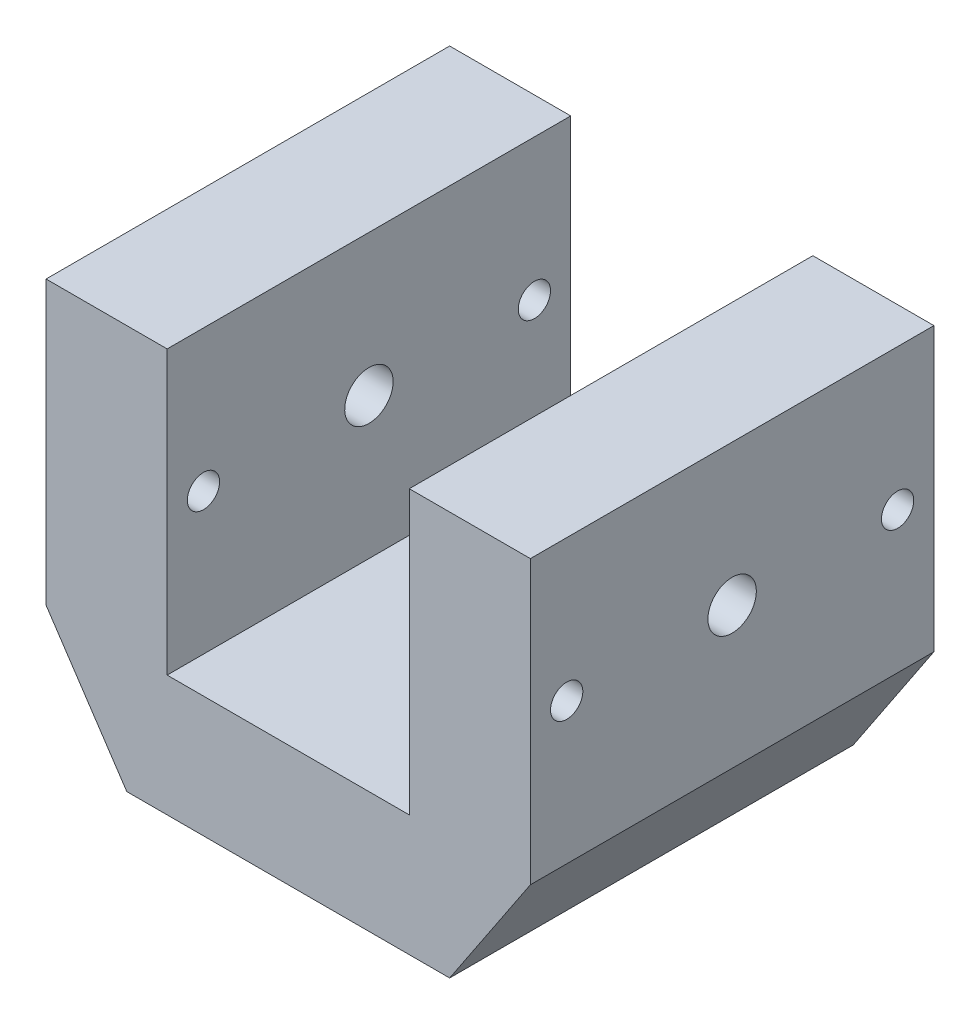
ISO-10303-21;
HEADER;
FILE_DESCRIPTION(('STEP AP214'),'2;1');
FILE_NAME('part.step','',(''),(''),'','','');
FILE_SCHEMA(('AUTOMOTIVE_DESIGN { 1 0 10303 214 1 1 1 1 }'));
ENDSEC;
DATA;
#1=APPLICATION_CONTEXT('core data for automotive mechanical design processes');
#2=APPLICATION_PROTOCOL_DEFINITION('international standard','automotive_design',2000,#1);
#3=PRODUCT_CONTEXT('',#1,'mechanical');
#4=PRODUCT('Part','Part','',(#3));
#5=PRODUCT_RELATED_PRODUCT_CATEGORY('part','',(#4));
#6=PRODUCT_DEFINITION_FORMATION('','',#4);
#7=PRODUCT_DEFINITION_CONTEXT('part definition',#1,'design');
#8=PRODUCT_DEFINITION('design','',#6,#7);
#9=PRODUCT_DEFINITION_SHAPE('','',#8);
#10=(LENGTH_UNIT() NAMED_UNIT(*) SI_UNIT(.MILLI.,.METRE.));
#11=(NAMED_UNIT(*) PLANE_ANGLE_UNIT() SI_UNIT($,.RADIAN.));
#12=(NAMED_UNIT(*) SI_UNIT($,.STERADIAN.) SOLID_ANGLE_UNIT());
#13=UNCERTAINTY_MEASURE_WITH_UNIT(LENGTH_MEASURE(1.E-05),#10,'distance_accuracy_value','');
#14=(GEOMETRIC_REPRESENTATION_CONTEXT(3) GLOBAL_UNCERTAINTY_ASSIGNED_CONTEXT((#13)) GLOBAL_UNIT_ASSIGNED_CONTEXT((#10,
#11,#12)) REPRESENTATION_CONTEXT('',''));
#15=CARTESIAN_POINT('',(0.,0.,0.));
#16=DIRECTION('',(0.,0.,1.));
#17=DIRECTION('',(1.,0.,0.));
#18=AXIS2_PLACEMENT_3D('',#15,#16,#17);
#19=CARTESIAN_POINT('',(0.,-50.,50.));
#20=DIRECTION('',(0.,1.,0.));
#21=DIRECTION('',(0.,0.,1.));
#22=AXIS2_PLACEMENT_3D('',#19,#20,#21);
#23=CYLINDRICAL_SURFACE('',#22,6.);
#24=CARTESIAN_POINT('',(0.,-50.,50.));
#25=DIRECTION('',(0.,1.,0.));
#26=DIRECTION('',(0.,0.,1.));
#27=AXIS2_PLACEMENT_3D('',#24,#25,#26);
#28=CIRCLE('',#27,6.);
#29=CARTESIAN_POINT('',(0.,-50.,56.));
#30=VERTEX_POINT('',#29);
#31=EDGE_CURVE('E225',#30,#30,#28,.T.);
#32=ORIENTED_EDGE('',*,*,#31,.F.);
#33=EDGE_LOOP('',(#32));
#34=FACE_BOUND('',#33,.T.);
#35=CARTESIAN_POINT('',(0.,-33.,50.));
#36=DIRECTION('',(0.,1.,0.));
#37=DIRECTION('',(-1.,0.,0.));
#38=AXIS2_PLACEMENT_3D('',#35,#36,#37);
#39=CIRCLE('',#38,6.);
#40=CARTESIAN_POINT('',(-6.,-33.,50.));
#41=VERTEX_POINT('',#40);
#42=EDGE_CURVE('E56',#41,#41,#39,.F.);
#43=ORIENTED_EDGE('',*,*,#42,.F.);
#44=EDGE_LOOP('',(#43));
#45=FACE_BOUND('',#44,.T.);
#46=ADVANCED_FACE('F52',(#34,#45),#23,.F.);
#47=CARTESIAN_POINT('',(-60.,-50.,100.));
#48=DIRECTION('',(0.,1.,0.));
#49=DIRECTION('',(-1.,0.,0.));
#50=AXIS2_PLACEMENT_3D('',#47,#48,#49);
#51=PLANE('',#50);
#52=ORIENTED_EDGE('',*,*,#31,.T.);
#53=EDGE_LOOP('',(#52));
#54=FACE_BOUND('',#53,.T.);
#55=DIRECTION('',(0.,0.,-1.));
#56=VECTOR('',#55,1.);
#57=CARTESIAN_POINT('',(-40.,-50.,100.));
#58=LINE('',#57,#56);
#59=CARTESIAN_POINT('',(-40.,-50.,100.));
#60=VERTEX_POINT('',#59);
#61=CARTESIAN_POINT('',(-40.,-50.,0.));
#62=VERTEX_POINT('',#61);
#63=EDGE_CURVE('E128',#60,#62,#58,.T.);
#64=ORIENTED_EDGE('',*,*,#63,.T.);
#65=DIRECTION('',(1.,0.,0.));
#66=VECTOR('',#65,1.);
#67=CARTESIAN_POINT('',(-60.,-50.,0.));
#68=LINE('',#67,#66);
#69=CARTESIAN_POINT('',(40.,-50.,0.));
#70=VERTEX_POINT('',#69);
#71=EDGE_CURVE('E136',#62,#70,#68,.T.);
#72=ORIENTED_EDGE('',*,*,#71,.T.);
#73=DIRECTION('',(0.,0.,-1.));
#74=VECTOR('',#73,1.);
#75=CARTESIAN_POINT('',(40.,-50.,100.));
#76=LINE('',#75,#74);
#77=CARTESIAN_POINT('',(40.,-50.,100.));
#78=VERTEX_POINT('',#77);
#79=EDGE_CURVE('E149',#78,#70,#76,.T.);
#80=ORIENTED_EDGE('',*,*,#79,.F.);
#81=DIRECTION('',(1.,0.,0.));
#82=VECTOR('',#81,1.);
#83=CARTESIAN_POINT('',(-60.,-50.,100.));
#84=LINE('',#83,#82);
#85=EDGE_CURVE('E143',#60,#78,#84,.T.);
#86=ORIENTED_EDGE('',*,*,#85,.F.);
#87=EDGE_LOOP('',(#64,#72,#80,#86));
#88=FACE_BOUND('',#87,.T.);
#89=ADVANCED_FACE('F54',(#54,#88),#51,.F.);
#90=CARTESIAN_POINT('',(60.,-50.,100.));
#91=DIRECTION('',(-1.,0.,0.));
#92=DIRECTION('',(0.,0.,1.));
#93=AXIS2_PLACEMENT_3D('',#90,#91,#92);
#94=PLANE('',#93);
#95=CARTESIAN_POINT('',(60.,15.,50.));
#96=DIRECTION('',(1.,0.,0.));
#97=DIRECTION('',(0.,0.,-1.));
#98=AXIS2_PLACEMENT_3D('',#95,#96,#97);
#99=CIRCLE('',#98,6.);
#100=CARTESIAN_POINT('',(60.,15.,44.));
#101=VERTEX_POINT('',#100);
#102=EDGE_CURVE('E203',#101,#101,#99,.T.);
#103=ORIENTED_EDGE('',*,*,#102,.F.);
#104=EDGE_LOOP('',(#103));
#105=FACE_BOUND('',#104,.T.);
#106=CARTESIAN_POINT('',(60.,15.,91.));
#107=DIRECTION('',(1.,0.,0.));
#108=DIRECTION('',(0.,0.,-1.));
#109=AXIS2_PLACEMENT_3D('',#106,#107,#108);
#110=CIRCLE('',#109,4.00000000000001);
#111=CARTESIAN_POINT('',(60.,15.,87.));
#112=VERTEX_POINT('',#111);
#113=EDGE_CURVE('E211',#112,#112,#110,.T.);
#114=ORIENTED_EDGE('',*,*,#113,.F.);
#115=EDGE_LOOP('',(#114));
#116=FACE_BOUND('',#115,.T.);
#117=CARTESIAN_POINT('',(60.,15.,9.));
#118=DIRECTION('',(1.,0.,0.));
#119=DIRECTION('',(0.,0.,-1.));
#120=AXIS2_PLACEMENT_3D('',#117,#118,#119);
#121=CIRCLE('',#120,4.);
#122=CARTESIAN_POINT('',(60.,15.,5.));
#123=VERTEX_POINT('',#122);
#124=EDGE_CURVE('E200',#123,#123,#121,.T.);
#125=ORIENTED_EDGE('',*,*,#124,.F.);
#126=EDGE_LOOP('',(#125));
#127=FACE_BOUND('',#126,.T.);
#128=DIRECTION('',(0.,0.,-1.));
#129=VECTOR('',#128,1.);
#130=CARTESIAN_POINT('',(60.,-20.,100.));
#131=LINE('',#130,#129);
#132=CARTESIAN_POINT('',(60.,-20.,100.));
#133=VERTEX_POINT('',#132);
#134=CARTESIAN_POINT('',(60.,-20.,0.));
#135=VERTEX_POINT('',#134);
#136=EDGE_CURVE('E159',#133,#135,#131,.T.);
#137=ORIENTED_EDGE('',*,*,#136,.T.);
#138=DIRECTION('',(0.,1.,0.));
#139=VECTOR('',#138,1.);
#140=CARTESIAN_POINT('',(60.,-50.,0.));
#141=LINE('',#140,#139);
#142=CARTESIAN_POINT('',(60.,50.,0.));
#143=VERTEX_POINT('',#142);
#144=EDGE_CURVE('E168',#135,#143,#141,.T.);
#145=ORIENTED_EDGE('',*,*,#144,.T.);
#146=DIRECTION('',(0.,0.,-1.));
#147=VECTOR('',#146,1.);
#148=CARTESIAN_POINT('',(60.,50.,100.));
#149=LINE('',#148,#147);
#150=CARTESIAN_POINT('',(60.,50.,100.));
#151=VERTEX_POINT('',#150);
#152=EDGE_CURVE('E175',#151,#143,#149,.T.);
#153=ORIENTED_EDGE('',*,*,#152,.F.);
#154=DIRECTION('',(0.,1.,0.));
#155=VECTOR('',#154,1.);
#156=CARTESIAN_POINT('',(60.,-50.,100.));
#157=LINE('',#156,#155);
#158=EDGE_CURVE('E150',#133,#151,#157,.T.);
#159=ORIENTED_EDGE('',*,*,#158,.F.);
#160=EDGE_LOOP('',(#137,#145,#153,#159));
#161=FACE_BOUND('',#160,.T.);
#162=ADVANCED_FACE('F252',(#105,#116,#127,#161),#94,.F.);
#163=CARTESIAN_POINT('',(-60.,50.,100.));
#164=DIRECTION('',(0.,-1.,0.));
#165=DIRECTION('',(1.,0.,0.));
#166=AXIS2_PLACEMENT_3D('',#163,#164,#165);
#167=PLANE('',#166);
#168=DIRECTION('',(0.,0.,-1.));
#169=VECTOR('',#168,1.);
#170=CARTESIAN_POINT('',(-30.,50.,100.));
#171=LINE('',#170,#169);
#172=CARTESIAN_POINT('',(-30.,50.,100.));
#173=VERTEX_POINT('',#172);
#174=CARTESIAN_POINT('',(-30.,50.,0.));
#175=VERTEX_POINT('',#174);
#176=EDGE_CURVE('E146',#173,#175,#171,.T.);
#177=ORIENTED_EDGE('',*,*,#176,.T.);
#178=DIRECTION('',(-1.,0.,0.));
#179=VECTOR('',#178,1.);
#180=CARTESIAN_POINT('',(-60.,50.,0.));
#181=LINE('',#180,#179);
#182=CARTESIAN_POINT('',(-60.,50.,0.));
#183=VERTEX_POINT('',#182);
#184=EDGE_CURVE('E170',#175,#183,#181,.T.);
#185=ORIENTED_EDGE('',*,*,#184,.T.);
#186=DIRECTION('',(0.,0.,-1.));
#187=VECTOR('',#186,1.);
#188=CARTESIAN_POINT('',(-60.,50.,100.));
#189=LINE('',#188,#187);
#190=CARTESIAN_POINT('',(-60.,50.,100.));
#191=VERTEX_POINT('',#190);
#192=EDGE_CURVE('E166',#191,#183,#189,.T.);
#193=ORIENTED_EDGE('',*,*,#192,.F.);
#194=DIRECTION('',(-1.,0.,0.));
#195=VECTOR('',#194,1.);
#196=CARTESIAN_POINT('',(-60.,50.,100.));
#197=LINE('',#196,#195);
#198=EDGE_CURVE('E153',#173,#191,#197,.T.);
#199=ORIENTED_EDGE('',*,*,#198,.F.);
#200=EDGE_LOOP('',(#177,#185,#193,#199));
#201=FACE_BOUND('',#200,.T.);
#202=ADVANCED_FACE('F312',(#201),#167,.F.);
#203=DIRECTION('',(0.,0.,-1.));
#204=VECTOR('',#203,1.);
#205=CARTESIAN_POINT('',(30.,50.,100.));
#206=LINE('',#205,#204);
#207=CARTESIAN_POINT('',(30.,50.,100.));
#208=VERTEX_POINT('',#207);
#209=CARTESIAN_POINT('',(30.,50.,0.));
#210=VERTEX_POINT('',#209);
#211=EDGE_CURVE('E69',#208,#210,#206,.T.);
#212=ORIENTED_EDGE('',*,*,#211,.F.);
#213=EDGE_CURVE('E162',#151,#208,#197,.T.);
#214=ORIENTED_EDGE('',*,*,#213,.F.);
#215=ORIENTED_EDGE('',*,*,#152,.T.);
#216=EDGE_CURVE('E156',#143,#210,#181,.T.);
#217=ORIENTED_EDGE('',*,*,#216,.T.);
#218=EDGE_LOOP('',(#212,#214,#215,#217));
#219=FACE_BOUND('',#218,.T.);
#220=ADVANCED_FACE('F259',(#219),#167,.F.);
#221=CARTESIAN_POINT('',(-60.,-50.,100.));
#222=DIRECTION('',(1.,0.,0.));
#223=DIRECTION('',(0.,0.,-1.));
#224=AXIS2_PLACEMENT_3D('',#221,#222,#223);
#225=PLANE('',#224);
#226=CARTESIAN_POINT('',(-60.,15.,50.));
#227=DIRECTION('',(1.,0.,0.));
#228=DIRECTION('',(0.,0.,-1.));
#229=AXIS2_PLACEMENT_3D('',#226,#227,#228);
#230=CIRCLE('',#229,6.);
#231=CARTESIAN_POINT('',(-60.,15.,44.));
#232=VERTEX_POINT('',#231);
#233=EDGE_CURVE('E196',#232,#232,#230,.T.);
#234=ORIENTED_EDGE('',*,*,#233,.T.);
#235=EDGE_LOOP('',(#234));
#236=FACE_BOUND('',#235,.T.);
#237=CARTESIAN_POINT('',(-60.,15.,91.));
#238=DIRECTION('',(1.,0.,0.));
#239=DIRECTION('',(0.,0.,-1.));
#240=AXIS2_PLACEMENT_3D('',#237,#238,#239);
#241=CIRCLE('',#240,4.00000000000001);
#242=CARTESIAN_POINT('',(-60.,15.,87.));
#243=VERTEX_POINT('',#242);
#244=EDGE_CURVE('E189',#243,#243,#241,.T.);
#245=ORIENTED_EDGE('',*,*,#244,.T.);
#246=EDGE_LOOP('',(#245));
#247=FACE_BOUND('',#246,.T.);
#248=CARTESIAN_POINT('',(-60.,15.,9.));
#249=DIRECTION('',(1.,0.,0.));
#250=DIRECTION('',(0.,0.,-1.));
#251=AXIS2_PLACEMENT_3D('',#248,#249,#250);
#252=CIRCLE('',#251,4.);
#253=CARTESIAN_POINT('',(-60.,15.,5.));
#254=VERTEX_POINT('',#253);
#255=EDGE_CURVE('E214',#254,#254,#252,.T.);
#256=ORIENTED_EDGE('',*,*,#255,.T.);
#257=EDGE_LOOP('',(#256));
#258=FACE_BOUND('',#257,.T.);
#259=DIRECTION('',(0.,0.,-1.));
#260=VECTOR('',#259,1.);
#261=CARTESIAN_POINT('',(-60.,-20.,100.));
#262=LINE('',#261,#260);
#263=CARTESIAN_POINT('',(-60.,-20.,100.));
#264=VERTEX_POINT('',#263);
#265=CARTESIAN_POINT('',(-60.,-20.,0.));
#266=VERTEX_POINT('',#265);
#267=EDGE_CURVE('E76',#264,#266,#262,.T.);
#268=ORIENTED_EDGE('',*,*,#267,.F.);
#269=DIRECTION('',(0.,-1.,0.));
#270=VECTOR('',#269,1.);
#271=CARTESIAN_POINT('',(-60.,-50.,100.));
#272=LINE('',#271,#270);
#273=EDGE_CURVE('E145',#191,#264,#272,.T.);
#274=ORIENTED_EDGE('',*,*,#273,.F.);
#275=ORIENTED_EDGE('',*,*,#192,.T.);
#276=DIRECTION('',(0.,-1.,0.));
#277=VECTOR('',#276,1.);
#278=CARTESIAN_POINT('',(-60.,-50.,0.));
#279=LINE('',#278,#277);
#280=EDGE_CURVE('E151',#183,#266,#279,.T.);
#281=ORIENTED_EDGE('',*,*,#280,.T.);
#282=EDGE_LOOP('',(#268,#274,#275,#281));
#283=FACE_BOUND('',#282,.T.);
#284=ADVANCED_FACE('F315',(#236,#247,#258,#283),#225,.F.);
#285=CARTESIAN_POINT('',(0.,0.,100.));
#286=DIRECTION('',(0.,0.,1.));
#287=DIRECTION('',(1.,0.,0.));
#288=AXIS2_PLACEMENT_3D('',#285,#286,#287);
#289=PLANE('',#288);
#290=ORIENTED_EDGE('',*,*,#273,.T.);
#291=DIRECTION('',(-0.554700196225229,0.832050294337843,0.));
#292=VECTOR('',#291,1.);
#293=CARTESIAN_POINT('',(-60.,-20.,100.));
#294=LINE('',#293,#292);
#295=EDGE_CURVE('E131',#60,#264,#294,.T.);
#296=ORIENTED_EDGE('',*,*,#295,.F.);
#297=ORIENTED_EDGE('',*,*,#85,.T.);
#298=DIRECTION('',(-0.554700196225229,-0.832050294337844,0.));
#299=VECTOR('',#298,1.);
#300=CARTESIAN_POINT('',(60.,-20.,100.));
#301=LINE('',#300,#299);
#302=EDGE_CURVE('E228',#133,#78,#301,.T.);
#303=ORIENTED_EDGE('',*,*,#302,.F.);
#304=ORIENTED_EDGE('',*,*,#158,.T.);
#305=ORIENTED_EDGE('',*,*,#213,.T.);
#306=DIRECTION('',(0.,1.,0.));
#307=VECTOR('',#306,1.);
#308=CARTESIAN_POINT('',(30.,50.,100.));
#309=LINE('',#308,#307);
#310=CARTESIAN_POINT('',(30.,-20.,100.));
#311=VERTEX_POINT('',#310);
#312=EDGE_CURVE('E235',#311,#208,#309,.T.);
#313=ORIENTED_EDGE('',*,*,#312,.F.);
#314=DIRECTION('',(1.,0.,0.));
#315=VECTOR('',#314,1.);
#316=CARTESIAN_POINT('',(-30.,-20.,100.));
#317=LINE('',#316,#315);
#318=CARTESIAN_POINT('',(-30.,-20.,100.));
#319=VERTEX_POINT('',#318);
#320=EDGE_CURVE('E233',#319,#311,#317,.T.);
#321=ORIENTED_EDGE('',*,*,#320,.F.);
#322=DIRECTION('',(0.,-1.,0.));
#323=VECTOR('',#322,1.);
#324=CARTESIAN_POINT('',(-30.,50.,100.));
#325=LINE('',#324,#323);
#326=EDGE_CURVE('E231',#173,#319,#325,.T.);
#327=ORIENTED_EDGE('',*,*,#326,.F.);
#328=ORIENTED_EDGE('',*,*,#198,.T.);
#329=EDGE_LOOP('',(#290,#296,#297,#303,#304,#305,#313,#321,#327,#328));
#330=FACE_BOUND('',#329,.T.);
#331=ADVANCED_FACE('F141',(#330),#289,.T.);
#332=CARTESIAN_POINT('',(0.,0.,0.));
#333=DIRECTION('',(0.,0.,1.));
#334=DIRECTION('',(1.,0.,0.));
#335=AXIS2_PLACEMENT_3D('',#332,#333,#334);
#336=PLANE('',#335);
#337=DIRECTION('',(0.554700196225229,-0.832050294337844,0.));
#338=VECTOR('',#337,1.);
#339=CARTESIAN_POINT('',(-50.7692307692308,-33.8461538461539,0.));
#340=LINE('',#339,#338);
#341=EDGE_CURVE('E13',#266,#62,#340,.T.);
#342=ORIENTED_EDGE('',*,*,#341,.F.);
#343=ORIENTED_EDGE('',*,*,#280,.F.);
#344=ORIENTED_EDGE('',*,*,#184,.F.);
#345=DIRECTION('',(0.,1.,0.));
#346=VECTOR('',#345,1.);
#347=CARTESIAN_POINT('',(-30.,0.,0.));
#348=LINE('',#347,#346);
#349=CARTESIAN_POINT('',(-30.,-20.,0.));
#350=VERTEX_POINT('',#349);
#351=EDGE_CURVE('E61',#350,#175,#348,.T.);
#352=ORIENTED_EDGE('',*,*,#351,.F.);
#353=DIRECTION('',(-1.,0.,0.));
#354=VECTOR('',#353,1.);
#355=CARTESIAN_POINT('',(0.,-20.,0.));
#356=LINE('',#355,#354);
#357=CARTESIAN_POINT('',(30.,-20.,0.));
#358=VERTEX_POINT('',#357);
#359=EDGE_CURVE('E182',#358,#350,#356,.T.);
#360=ORIENTED_EDGE('',*,*,#359,.F.);
#361=DIRECTION('',(0.,-1.,0.));
#362=VECTOR('',#361,1.);
#363=CARTESIAN_POINT('',(30.,0.,0.));
#364=LINE('',#363,#362);
#365=EDGE_CURVE('E180',#210,#358,#364,.T.);
#366=ORIENTED_EDGE('',*,*,#365,.F.);
#367=ORIENTED_EDGE('',*,*,#216,.F.);
#368=ORIENTED_EDGE('',*,*,#144,.F.);
#369=DIRECTION('',(0.554700196225229,0.832050294337844,0.));
#370=VECTOR('',#369,1.);
#371=CARTESIAN_POINT('',(50.7692307692308,-33.8461538461539,0.));
#372=LINE('',#371,#370);
#373=EDGE_CURVE('E178',#70,#135,#372,.T.);
#374=ORIENTED_EDGE('',*,*,#373,.F.);
#375=ORIENTED_EDGE('',*,*,#71,.F.);
#376=EDGE_LOOP('',(#342,#343,#344,#352,#360,#366,#367,#368,#374,#375));
#377=FACE_BOUND('',#376,.T.);
#378=ADVANCED_FACE('F256',(#377),#336,.F.);
#379=CARTESIAN_POINT('',(60.,-20.,100.));
#380=DIRECTION('',(0.832050294337844,-0.554700196225229,0.));
#381=DIRECTION('',(0.554700196225229,0.832050294337844,0.));
#382=AXIS2_PLACEMENT_3D('',#379,#380,#381);
#383=PLANE('',#382);
#384=ORIENTED_EDGE('',*,*,#373,.T.);
#385=ORIENTED_EDGE('',*,*,#136,.F.);
#386=ORIENTED_EDGE('',*,*,#302,.T.);
#387=ORIENTED_EDGE('',*,*,#79,.T.);
#388=EDGE_LOOP('',(#384,#385,#386,#387));
#389=FACE_BOUND('',#388,.T.);
#390=ADVANCED_FACE('F263',(#389),#383,.T.);
#391=CARTESIAN_POINT('',(-30.,50.,100.));
#392=DIRECTION('',(1.,0.,0.));
#393=DIRECTION('',(0.,1.,0.));
#394=AXIS2_PLACEMENT_3D('',#391,#392,#393);
#395=PLANE('',#394);
#396=CARTESIAN_POINT('',(-30.,15.,50.));
#397=DIRECTION('',(1.,0.,0.));
#398=DIRECTION('',(0.,1.,0.));
#399=AXIS2_PLACEMENT_3D('',#396,#397,#398);
#400=CIRCLE('',#399,6.);
#401=CARTESIAN_POINT('',(-30.,21.,50.));
#402=VERTEX_POINT('',#401);
#403=EDGE_CURVE('E195',#402,#402,#400,.T.);
#404=ORIENTED_EDGE('',*,*,#403,.F.);
#405=EDGE_LOOP('',(#404));
#406=FACE_BOUND('',#405,.T.);
#407=CARTESIAN_POINT('',(-30.,15.,91.));
#408=DIRECTION('',(1.,0.,0.));
#409=DIRECTION('',(0.,1.,0.));
#410=AXIS2_PLACEMENT_3D('',#407,#408,#409);
#411=CIRCLE('',#410,4.00000000000001);
#412=CARTESIAN_POINT('',(-30.,19.,91.));
#413=VERTEX_POINT('',#412);
#414=EDGE_CURVE('E192',#413,#413,#411,.T.);
#415=ORIENTED_EDGE('',*,*,#414,.F.);
#416=EDGE_LOOP('',(#415));
#417=FACE_BOUND('',#416,.T.);
#418=CARTESIAN_POINT('',(-30.,15.,9.));
#419=DIRECTION('',(1.,0.,0.));
#420=DIRECTION('',(0.,1.,0.));
#421=AXIS2_PLACEMENT_3D('',#418,#419,#420);
#422=CIRCLE('',#421,4.);
#423=CARTESIAN_POINT('',(-30.,19.,9.));
#424=VERTEX_POINT('',#423);
#425=EDGE_CURVE('E188',#424,#424,#422,.T.);
#426=ORIENTED_EDGE('',*,*,#425,.F.);
#427=EDGE_LOOP('',(#426));
#428=FACE_BOUND('',#427,.T.);
#429=ORIENTED_EDGE('',*,*,#351,.T.);
#430=ORIENTED_EDGE('',*,*,#176,.F.);
#431=ORIENTED_EDGE('',*,*,#326,.T.);
#432=DIRECTION('',(0.,0.,-1.));
#433=VECTOR('',#432,1.);
#434=CARTESIAN_POINT('',(-30.,-20.,100.));
#435=LINE('',#434,#433);
#436=EDGE_CURVE('E241',#319,#350,#435,.T.);
#437=ORIENTED_EDGE('',*,*,#436,.T.);
#438=EDGE_LOOP('',(#429,#430,#431,#437));
#439=FACE_BOUND('',#438,.T.);
#440=ADVANCED_FACE('F265',(#406,#417,#428,#439),#395,.T.);
#441=CARTESIAN_POINT('',(-30.,-20.,100.));
#442=DIRECTION('',(0.,1.,0.));
#443=DIRECTION('',(-1.,0.,0.));
#444=AXIS2_PLACEMENT_3D('',#441,#442,#443);
#445=PLANE('',#444);
#446=CARTESIAN_POINT('',(0.,-20.,50.));
#447=DIRECTION('',(0.,1.,0.));
#448=DIRECTION('',(-1.,0.,0.));
#449=AXIS2_PLACEMENT_3D('',#446,#447,#448);
#450=CIRCLE('',#449,11.);
#451=CARTESIAN_POINT('',(-11.,-20.,50.));
#452=VERTEX_POINT('',#451);
#453=EDGE_CURVE('E302',#452,#452,#450,.T.);
#454=ORIENTED_EDGE('',*,*,#453,.F.);
#455=EDGE_LOOP('',(#454));
#456=FACE_BOUND('',#455,.T.);
#457=ORIENTED_EDGE('',*,*,#359,.T.);
#458=ORIENTED_EDGE('',*,*,#436,.F.);
#459=ORIENTED_EDGE('',*,*,#320,.T.);
#460=DIRECTION('',(0.,0.,-1.));
#461=VECTOR('',#460,1.);
#462=CARTESIAN_POINT('',(30.,-20.,100.));
#463=LINE('',#462,#461);
#464=EDGE_CURVE('E238',#311,#358,#463,.T.);
#465=ORIENTED_EDGE('',*,*,#464,.T.);
#466=EDGE_LOOP('',(#457,#458,#459,#465));
#467=FACE_BOUND('',#466,.T.);
#468=ADVANCED_FACE('F271',(#456,#467),#445,.T.);
#469=CARTESIAN_POINT('',(30.,50.,100.));
#470=DIRECTION('',(-1.,0.,0.));
#471=DIRECTION('',(0.,-1.,0.));
#472=AXIS2_PLACEMENT_3D('',#469,#470,#471);
#473=PLANE('',#472);
#474=CARTESIAN_POINT('',(30.,15.,50.));
#475=DIRECTION('',(-1.,0.,0.));
#476=DIRECTION('',(0.,-1.,0.));
#477=AXIS2_PLACEMENT_3D('',#474,#475,#476);
#478=CIRCLE('',#477,6.);
#479=CARTESIAN_POINT('',(30.,9.00000000000001,50.));
#480=VERTEX_POINT('',#479);
#481=EDGE_CURVE('E193',#480,#480,#478,.T.);
#482=ORIENTED_EDGE('',*,*,#481,.F.);
#483=EDGE_LOOP('',(#482));
#484=FACE_BOUND('',#483,.T.);
#485=CARTESIAN_POINT('',(30.,15.,91.));
#486=DIRECTION('',(-1.,0.,0.));
#487=DIRECTION('',(0.,-1.,0.));
#488=AXIS2_PLACEMENT_3D('',#485,#486,#487);
#489=CIRCLE('',#488,4.00000000000001);
#490=CARTESIAN_POINT('',(30.,11.,91.));
#491=VERTEX_POINT('',#490);
#492=EDGE_CURVE('E190',#491,#491,#489,.T.);
#493=ORIENTED_EDGE('',*,*,#492,.F.);
#494=EDGE_LOOP('',(#493));
#495=FACE_BOUND('',#494,.T.);
#496=CARTESIAN_POINT('',(30.,15.,9.));
#497=DIRECTION('',(-1.,0.,0.));
#498=DIRECTION('',(0.,-1.,0.));
#499=AXIS2_PLACEMENT_3D('',#496,#497,#498);
#500=CIRCLE('',#499,4.);
#501=CARTESIAN_POINT('',(30.,11.,9.));
#502=VERTEX_POINT('',#501);
#503=EDGE_CURVE('E185',#502,#502,#500,.T.);
#504=ORIENTED_EDGE('',*,*,#503,.F.);
#505=EDGE_LOOP('',(#504));
#506=FACE_BOUND('',#505,.T.);
#507=ORIENTED_EDGE('',*,*,#365,.T.);
#508=ORIENTED_EDGE('',*,*,#464,.F.);
#509=ORIENTED_EDGE('',*,*,#312,.T.);
#510=ORIENTED_EDGE('',*,*,#211,.T.);
#511=EDGE_LOOP('',(#507,#508,#509,#510));
#512=FACE_BOUND('',#511,.T.);
#513=ADVANCED_FACE('F291',(#484,#495,#506,#512),#473,.T.);
#514=CARTESIAN_POINT('',(-60.,-20.,100.));
#515=DIRECTION('',(-0.832050294337844,-0.554700196225229,0.));
#516=DIRECTION('',(0.554700196225229,-0.832050294337844,0.));
#517=AXIS2_PLACEMENT_3D('',#514,#515,#516);
#518=PLANE('',#517);
#519=ORIENTED_EDGE('',*,*,#341,.T.);
#520=ORIENTED_EDGE('',*,*,#63,.F.);
#521=ORIENTED_EDGE('',*,*,#295,.T.);
#522=ORIENTED_EDGE('',*,*,#267,.T.);
#523=EDGE_LOOP('',(#519,#520,#521,#522));
#524=FACE_BOUND('',#523,.T.);
#525=ADVANCED_FACE('F130',(#524),#518,.T.);
#526=CARTESIAN_POINT('',(-60.,15.,9.));
#527=DIRECTION('',(1.,0.,0.));
#528=DIRECTION('',(0.,0.,-1.));
#529=AXIS2_PLACEMENT_3D('',#526,#527,#528);
#530=CYLINDRICAL_SURFACE('',#529,4.);
#531=ORIENTED_EDGE('',*,*,#503,.T.);
#532=EDGE_LOOP('',(#531));
#533=FACE_BOUND('',#532,.T.);
#534=ORIENTED_EDGE('',*,*,#124,.T.);
#535=EDGE_LOOP('',(#534));
#536=FACE_BOUND('',#535,.T.);
#537=ADVANCED_FACE('F287',(#533,#536),#530,.F.);
#538=CARTESIAN_POINT('',(-60.,15.,91.));
#539=DIRECTION('',(1.,0.,0.));
#540=DIRECTION('',(0.,0.,-1.));
#541=AXIS2_PLACEMENT_3D('',#538,#539,#540);
#542=CYLINDRICAL_SURFACE('',#541,4.00000000000001);
#543=ORIENTED_EDGE('',*,*,#492,.T.);
#544=EDGE_LOOP('',(#543));
#545=FACE_BOUND('',#544,.T.);
#546=ORIENTED_EDGE('',*,*,#113,.T.);
#547=EDGE_LOOP('',(#546));
#548=FACE_BOUND('',#547,.T.);
#549=ADVANCED_FACE('F336',(#545,#548),#542,.F.);
#550=ORIENTED_EDGE('',*,*,#425,.T.);
#551=EDGE_LOOP('',(#550));
#552=FACE_BOUND('',#551,.T.);
#553=ORIENTED_EDGE('',*,*,#255,.F.);
#554=EDGE_LOOP('',(#553));
#555=FACE_BOUND('',#554,.T.);
#556=ADVANCED_FACE('F338',(#552,#555),#530,.F.);
#557=ORIENTED_EDGE('',*,*,#414,.T.);
#558=EDGE_LOOP('',(#557));
#559=FACE_BOUND('',#558,.T.);
#560=ORIENTED_EDGE('',*,*,#244,.F.);
#561=EDGE_LOOP('',(#560));
#562=FACE_BOUND('',#561,.T.);
#563=ADVANCED_FACE('F343',(#559,#562),#542,.F.);
#564=CARTESIAN_POINT('',(-60.,15.,50.));
#565=DIRECTION('',(1.,0.,0.));
#566=DIRECTION('',(0.,0.,-1.));
#567=AXIS2_PLACEMENT_3D('',#564,#565,#566);
#568=CYLINDRICAL_SURFACE('',#567,6.);
#569=ORIENTED_EDGE('',*,*,#481,.T.);
#570=EDGE_LOOP('',(#569));
#571=FACE_BOUND('',#570,.T.);
#572=ORIENTED_EDGE('',*,*,#102,.T.);
#573=EDGE_LOOP('',(#572));
#574=FACE_BOUND('',#573,.T.);
#575=ADVANCED_FACE('F349',(#571,#574),#568,.F.);
#576=ORIENTED_EDGE('',*,*,#403,.T.);
#577=EDGE_LOOP('',(#576));
#578=FACE_BOUND('',#577,.T.);
#579=ORIENTED_EDGE('',*,*,#233,.F.);
#580=EDGE_LOOP('',(#579));
#581=FACE_BOUND('',#580,.T.);
#582=ADVANCED_FACE('F359',(#578,#581),#568,.F.);
#583=CARTESIAN_POINT('',(0.,-33.,50.));
#584=DIRECTION('',(0.,1.,0.));
#585=DIRECTION('',(-1.,0.,0.));
#586=AXIS2_PLACEMENT_3D('',#583,#584,#585);
#587=PLANE('',#586);
#588=CARTESIAN_POINT('',(0.,-33.,50.));
#589=DIRECTION('',(0.,1.,0.));
#590=DIRECTION('',(-1.,0.,0.));
#591=AXIS2_PLACEMENT_3D('',#588,#589,#590);
#592=CIRCLE('',#591,11.);
#593=CARTESIAN_POINT('',(-11.,-33.,50.));
#594=VERTEX_POINT('',#593);
#595=EDGE_CURVE('E377',#594,#594,#592,.T.);
#596=ORIENTED_EDGE('',*,*,#595,.T.);
#597=EDGE_LOOP('',(#596));
#598=FACE_BOUND('',#597,.T.);
#599=ORIENTED_EDGE('',*,*,#42,.T.);
#600=EDGE_LOOP('',(#599));
#601=FACE_BOUND('',#600,.T.);
#602=ADVANCED_FACE('F366',(#598,#601),#587,.T.);
#603=CARTESIAN_POINT('',(0.,-33.,50.));
#604=DIRECTION('',(0.,1.,0.));
#605=DIRECTION('',(0.,0.,1.));
#606=AXIS2_PLACEMENT_3D('',#603,#604,#605);
#607=CYLINDRICAL_SURFACE('',#606,11.);
#608=ORIENTED_EDGE('',*,*,#595,.F.);
#609=EDGE_LOOP('',(#608));
#610=FACE_BOUND('',#609,.T.);
#611=ORIENTED_EDGE('',*,*,#453,.T.);
#612=EDGE_LOOP('',(#611));
#613=FACE_BOUND('',#612,.T.);
#614=ADVANCED_FACE('F363',(#610,#613),#607,.F.);
#615=CLOSED_SHELL('',(#46,#89,#162,#202,#220,#284,#331,#378,#390,#440,#468,#513,#525,#537,#549,
#556,#563,#575,#582,#602,#614));
#616=MANIFOLD_SOLID_BREP('B2',#615);
#617=ADVANCED_BREP_SHAPE_REPRESENTATION('',(#18,#616),#14);
#618=SHAPE_DEFINITION_REPRESENTATION(#9,#617);
ENDSEC;
END-ISO-10303-21;
